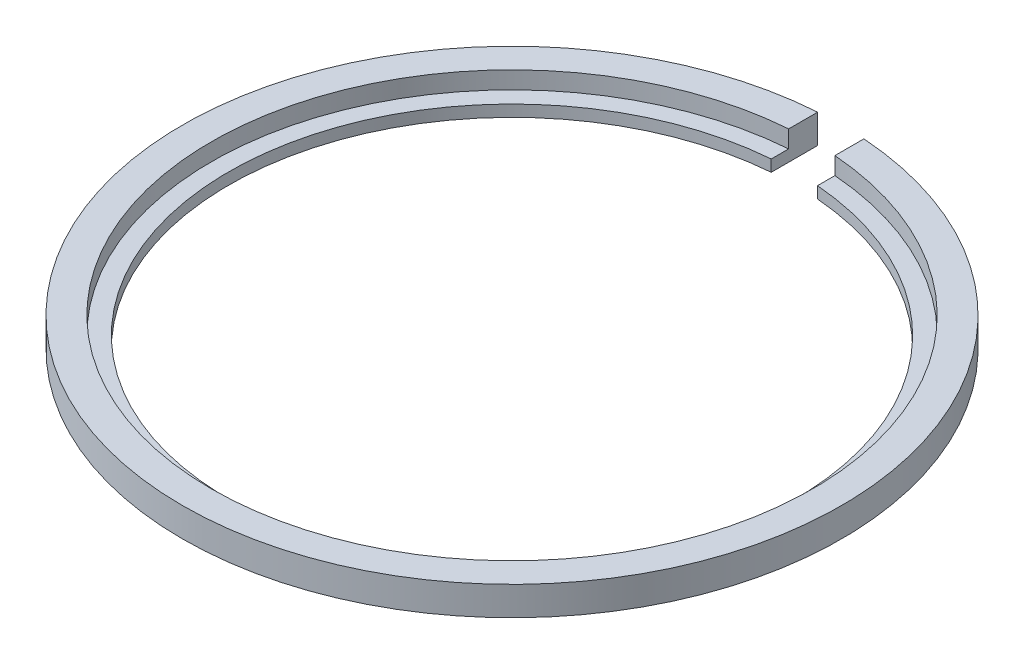
ISO-10303-21;
HEADER;
FILE_DESCRIPTION(('STEP AP214'),'2;1');
FILE_NAME('part.step','',(''),(''),'','','');
FILE_SCHEMA(('AUTOMOTIVE_DESIGN { 1 0 10303 214 1 1 1 1 }'));
ENDSEC;
DATA;
#1=APPLICATION_CONTEXT('core data for automotive mechanical design processes');
#2=APPLICATION_PROTOCOL_DEFINITION('international standard','automotive_design',2000,#1);
#3=PRODUCT_CONTEXT('',#1,'mechanical');
#4=PRODUCT('Part','Part','',(#3));
#5=PRODUCT_RELATED_PRODUCT_CATEGORY('part','',(#4));
#6=PRODUCT_DEFINITION_FORMATION('','',#4);
#7=PRODUCT_DEFINITION_CONTEXT('part definition',#1,'design');
#8=PRODUCT_DEFINITION('design','',#6,#7);
#9=PRODUCT_DEFINITION_SHAPE('','',#8);
#10=(LENGTH_UNIT() NAMED_UNIT(*) SI_UNIT(.MILLI.,.METRE.));
#11=(NAMED_UNIT(*) PLANE_ANGLE_UNIT() SI_UNIT($,.RADIAN.));
#12=(NAMED_UNIT(*) SI_UNIT($,.STERADIAN.) SOLID_ANGLE_UNIT());
#13=UNCERTAINTY_MEASURE_WITH_UNIT(LENGTH_MEASURE(1.E-05),#10,'distance_accuracy_value','');
#14=(GEOMETRIC_REPRESENTATION_CONTEXT(3) GLOBAL_UNCERTAINTY_ASSIGNED_CONTEXT((#13)) GLOBAL_UNIT_ASSIGNED_CONTEXT((#10,
#11,#12)) REPRESENTATION_CONTEXT('',''));
#15=CARTESIAN_POINT('',(0.,0.,0.));
#16=DIRECTION('',(0.,0.,1.));
#17=DIRECTION('',(1.,0.,0.));
#18=AXIS2_PLACEMENT_3D('',#15,#16,#17);
#19=CARTESIAN_POINT('',(0.,27.2585381463305,0.));
#20=DIRECTION('',(0.,1.,0.));
#21=DIRECTION('',(0.,0.,1.));
#22=AXIS2_PLACEMENT_3D('',#19,#20,#21);
#23=CYLINDRICAL_SURFACE('',#22,24.5);
#24=CARTESIAN_POINT('',(0.,0.,0.));
#25=DIRECTION('',(0.,1.,0.));
#26=DIRECTION('',(0.,0.,1.));
#27=AXIS2_PLACEMENT_3D('',#24,#25,#26);
#28=CIRCLE('',#27,24.5);
#29=CARTESIAN_POINT('',(-2.00000000000002,0.,-24.4182308941496));
#30=VERTEX_POINT('',#29);
#31=CARTESIAN_POINT('',(2.,0.,-24.4182308941496));
#32=VERTEX_POINT('',#31);
#33=EDGE_CURVE('E110',#30,#32,#28,.T.);
#34=ORIENTED_EDGE('',*,*,#33,.F.);
#35=DIRECTION('',(0.,1.,0.));
#36=VECTOR('',#35,1.);
#37=CARTESIAN_POINT('',(-2.00000000000002,27.2585381463305,-24.4182308941496));
#38=LINE('',#37,#36);
#39=CARTESIAN_POINT('',(-2.00000000000002,1.,-24.4182308941496));
#40=VERTEX_POINT('',#39);
#41=EDGE_CURVE('E134',#30,#40,#38,.T.);
#42=ORIENTED_EDGE('',*,*,#41,.T.);
#43=CARTESIAN_POINT('',(0.,1.,0.));
#44=DIRECTION('',(0.,1.,0.));
#45=DIRECTION('',(0.,0.,1.));
#46=AXIS2_PLACEMENT_3D('',#43,#44,#45);
#47=CIRCLE('',#46,24.5);
#48=CARTESIAN_POINT('',(2.,1.,-24.4182308941496));
#49=VERTEX_POINT('',#48);
#50=EDGE_CURVE('E112',#40,#49,#47,.T.);
#51=ORIENTED_EDGE('',*,*,#50,.T.);
#52=DIRECTION('',(0.,1.,0.));
#53=VECTOR('',#52,1.);
#54=CARTESIAN_POINT('',(2.,27.2585381463305,-24.4182308941496));
#55=LINE('',#54,#53);
#56=EDGE_CURVE('E67',#32,#49,#55,.T.);
#57=ORIENTED_EDGE('',*,*,#56,.F.);
#58=EDGE_LOOP('',(#34,#42,#51,#57));
#59=FACE_BOUND('',#58,.T.);
#60=ADVANCED_FACE('F46',(#59),#23,.F.);
#61=CARTESIAN_POINT('',(24.5,0.,0.));
#62=DIRECTION('',(0.,1.,0.));
#63=DIRECTION('',(0.,0.,1.));
#64=AXIS2_PLACEMENT_3D('',#61,#62,#63);
#65=PLANE('',#64);
#66=CARTESIAN_POINT('',(0.,0.,0.));
#67=DIRECTION('',(0.,1.,0.));
#68=DIRECTION('',(0.,0.,1.));
#69=AXIS2_PLACEMENT_3D('',#66,#67,#68);
#70=CIRCLE('',#69,28.5);
#71=CARTESIAN_POINT('',(-2.00000000000002,0.,-28.429737951659));
#72=VERTEX_POINT('',#71);
#73=CARTESIAN_POINT('',(2.,0.,-28.429737951659));
#74=VERTEX_POINT('',#73);
#75=EDGE_CURVE('E117',#72,#74,#70,.T.);
#76=ORIENTED_EDGE('',*,*,#75,.F.);
#77=DIRECTION('',(0.,0.,-1.));
#78=VECTOR('',#77,1.);
#79=CARTESIAN_POINT('',(-2.00000000000002,0.,0.));
#80=LINE('',#79,#78);
#81=EDGE_CURVE('E104',#30,#72,#80,.T.);
#82=ORIENTED_EDGE('',*,*,#81,.F.);
#83=ORIENTED_EDGE('',*,*,#33,.T.);
#84=DIRECTION('',(0.,0.,-1.));
#85=VECTOR('',#84,1.);
#86=CARTESIAN_POINT('',(2.00000000000002,0.,0.));
#87=LINE('',#86,#85);
#88=EDGE_CURVE('E95',#32,#74,#87,.T.);
#89=ORIENTED_EDGE('',*,*,#88,.T.);
#90=EDGE_LOOP('',(#76,#82,#83,#89));
#91=FACE_BOUND('',#90,.T.);
#92=ADVANCED_FACE('F116',(#91),#65,.F.);
#93=CARTESIAN_POINT('',(0.,27.2585381463305,0.));
#94=DIRECTION('',(0.,1.,0.));
#95=DIRECTION('',(0.,0.,1.));
#96=AXIS2_PLACEMENT_3D('',#93,#94,#95);
#97=CYLINDRICAL_SURFACE('',#96,28.5);
#98=CARTESIAN_POINT('',(0.,2.5,0.));
#99=DIRECTION('',(0.,1.,0.));
#100=DIRECTION('',(0.,0.,1.));
#101=AXIS2_PLACEMENT_3D('',#98,#99,#100);
#102=CIRCLE('',#101,28.5);
#103=CARTESIAN_POINT('',(-2.00000000000002,2.5,-28.429737951659));
#104=VERTEX_POINT('',#103);
#105=CARTESIAN_POINT('',(2.,2.5,-28.429737951659));
#106=VERTEX_POINT('',#105);
#107=EDGE_CURVE('E119',#104,#106,#102,.T.);
#108=ORIENTED_EDGE('',*,*,#107,.F.);
#109=DIRECTION('',(0.,1.,0.));
#110=VECTOR('',#109,1.);
#111=CARTESIAN_POINT('',(-2.00000000000002,27.2585381463305,-28.429737951659));
#112=LINE('',#111,#110);
#113=EDGE_CURVE('E131',#104,#72,#112,.F.);
#114=ORIENTED_EDGE('',*,*,#113,.T.);
#115=ORIENTED_EDGE('',*,*,#75,.T.);
#116=DIRECTION('',(0.,1.,0.));
#117=VECTOR('',#116,1.);
#118=CARTESIAN_POINT('',(2.,27.2585381463305,-28.429737951659));
#119=LINE('',#118,#117);
#120=EDGE_CURVE('E98',#106,#74,#119,.F.);
#121=ORIENTED_EDGE('',*,*,#120,.F.);
#122=EDGE_LOOP('',(#108,#114,#115,#121));
#123=FACE_BOUND('',#122,.T.);
#124=ADVANCED_FACE('F149',(#123),#97,.T.);
#125=CARTESIAN_POINT('',(28.5,2.5,0.));
#126=DIRECTION('',(0.,-1.,0.));
#127=DIRECTION('',(0.,0.,-1.));
#128=AXIS2_PLACEMENT_3D('',#125,#126,#127);
#129=PLANE('',#128);
#130=CARTESIAN_POINT('',(0.,2.5,0.));
#131=DIRECTION('',(0.,1.,0.));
#132=DIRECTION('',(0.,0.,1.));
#133=AXIS2_PLACEMENT_3D('',#130,#131,#132);
#134=CIRCLE('',#133,26.);
#135=CARTESIAN_POINT('',(-2.00000000000002,2.5,-25.9229627936314));
#136=VERTEX_POINT('',#135);
#137=CARTESIAN_POINT('',(2.,2.5,-25.9229627936314));
#138=VERTEX_POINT('',#137);
#139=EDGE_CURVE('E124',#136,#138,#134,.T.);
#140=ORIENTED_EDGE('',*,*,#139,.F.);
#141=DIRECTION('',(0.,0.,-1.));
#142=VECTOR('',#141,1.);
#143=CARTESIAN_POINT('',(-2.00000000000002,2.5,0.));
#144=LINE('',#143,#142);
#145=EDGE_CURVE('E103',#136,#104,#144,.T.);
#146=ORIENTED_EDGE('',*,*,#145,.T.);
#147=ORIENTED_EDGE('',*,*,#107,.T.);
#148=DIRECTION('',(0.,0.,-1.));
#149=VECTOR('',#148,1.);
#150=CARTESIAN_POINT('',(2.00000000000002,2.5,0.));
#151=LINE('',#150,#149);
#152=EDGE_CURVE('E138',#138,#106,#151,.T.);
#153=ORIENTED_EDGE('',*,*,#152,.F.);
#154=EDGE_LOOP('',(#140,#146,#147,#153));
#155=FACE_BOUND('',#154,.T.);
#156=ADVANCED_FACE('F146',(#155),#129,.F.);
#157=CARTESIAN_POINT('',(0.,27.2585381463305,0.));
#158=DIRECTION('',(0.,1.,0.));
#159=DIRECTION('',(0.,0.,1.));
#160=AXIS2_PLACEMENT_3D('',#157,#158,#159);
#161=CYLINDRICAL_SURFACE('',#160,26.);
#162=CARTESIAN_POINT('',(0.,1.,0.));
#163=DIRECTION('',(0.,1.,0.));
#164=DIRECTION('',(0.,0.,1.));
#165=AXIS2_PLACEMENT_3D('',#162,#163,#164);
#166=CIRCLE('',#165,26.);
#167=CARTESIAN_POINT('',(-2.00000000000002,1.,-25.9229627936314));
#168=VERTEX_POINT('',#167);
#169=CARTESIAN_POINT('',(2.,1.,-25.9229627936314));
#170=VERTEX_POINT('',#169);
#171=EDGE_CURVE('E127',#168,#170,#166,.T.);
#172=ORIENTED_EDGE('',*,*,#171,.F.);
#173=DIRECTION('',(0.,1.,0.));
#174=VECTOR('',#173,1.);
#175=CARTESIAN_POINT('',(-2.00000000000002,27.2585381463305,-25.9229627936314));
#176=LINE('',#175,#174);
#177=EDGE_CURVE('E60',#168,#136,#176,.T.);
#178=ORIENTED_EDGE('',*,*,#177,.T.);
#179=ORIENTED_EDGE('',*,*,#139,.T.);
#180=DIRECTION('',(0.,1.,0.));
#181=VECTOR('',#180,1.);
#182=CARTESIAN_POINT('',(2.,27.2585381463305,-25.9229627936314));
#183=LINE('',#182,#181);
#184=EDGE_CURVE('E113',#170,#138,#183,.T.);
#185=ORIENTED_EDGE('',*,*,#184,.F.);
#186=EDGE_LOOP('',(#172,#178,#179,#185));
#187=FACE_BOUND('',#186,.T.);
#188=ADVANCED_FACE('F156',(#187),#161,.F.);
#189=CARTESIAN_POINT('',(26.,1.,0.));
#190=DIRECTION('',(0.,-1.,0.));
#191=DIRECTION('',(0.,0.,-1.));
#192=AXIS2_PLACEMENT_3D('',#189,#190,#191);
#193=PLANE('',#192);
#194=ORIENTED_EDGE('',*,*,#50,.F.);
#195=DIRECTION('',(0.,0.,-1.));
#196=VECTOR('',#195,1.);
#197=CARTESIAN_POINT('',(-2.00000000000002,1.,0.));
#198=LINE('',#197,#196);
#199=EDGE_CURVE('E13',#40,#168,#198,.T.);
#200=ORIENTED_EDGE('',*,*,#199,.T.);
#201=ORIENTED_EDGE('',*,*,#171,.T.);
#202=DIRECTION('',(0.,0.,-1.));
#203=VECTOR('',#202,1.);
#204=CARTESIAN_POINT('',(2.00000000000002,1.,0.));
#205=LINE('',#204,#203);
#206=EDGE_CURVE('E53',#49,#170,#205,.T.);
#207=ORIENTED_EDGE('',*,*,#206,.F.);
#208=EDGE_LOOP('',(#194,#200,#201,#207));
#209=FACE_BOUND('',#208,.T.);
#210=ADVANCED_FACE('F152',(#209),#193,.F.);
#211=CARTESIAN_POINT('',(2.00000000000002,2.5,0.));
#212=DIRECTION('',(-1.,0.,0.));
#213=DIRECTION('',(0.,0.,1.));
#214=AXIS2_PLACEMENT_3D('',#211,#212,#213);
#215=PLANE('',#214);
#216=ORIENTED_EDGE('',*,*,#120,.T.);
#217=ORIENTED_EDGE('',*,*,#88,.F.);
#218=ORIENTED_EDGE('',*,*,#56,.T.);
#219=ORIENTED_EDGE('',*,*,#206,.T.);
#220=ORIENTED_EDGE('',*,*,#184,.T.);
#221=ORIENTED_EDGE('',*,*,#152,.T.);
#222=EDGE_LOOP('',(#216,#217,#218,#219,#220,#221));
#223=FACE_BOUND('',#222,.T.);
#224=ADVANCED_FACE('F96',(#223),#215,.T.);
#225=CARTESIAN_POINT('',(-2.00000000000002,2.5,0.));
#226=DIRECTION('',(-1.,0.,0.));
#227=DIRECTION('',(0.,0.,1.));
#228=AXIS2_PLACEMENT_3D('',#225,#226,#227);
#229=PLANE('',#228);
#230=ORIENTED_EDGE('',*,*,#145,.F.);
#231=ORIENTED_EDGE('',*,*,#177,.F.);
#232=ORIENTED_EDGE('',*,*,#199,.F.);
#233=ORIENTED_EDGE('',*,*,#41,.F.);
#234=ORIENTED_EDGE('',*,*,#81,.T.);
#235=ORIENTED_EDGE('',*,*,#113,.F.);
#236=EDGE_LOOP('',(#230,#231,#232,#233,#234,#235));
#237=FACE_BOUND('',#236,.T.);
#238=ADVANCED_FACE('F150',(#237),#229,.F.);
#239=CLOSED_SHELL('',(#60,#92,#124,#156,#188,#210,#224,#238));
#240=MANIFOLD_SOLID_BREP('B2',#239);
#241=ADVANCED_BREP_SHAPE_REPRESENTATION('',(#18,#240),#14);
#242=SHAPE_DEFINITION_REPRESENTATION(#9,#241);
ENDSEC;
END-ISO-10303-21;
